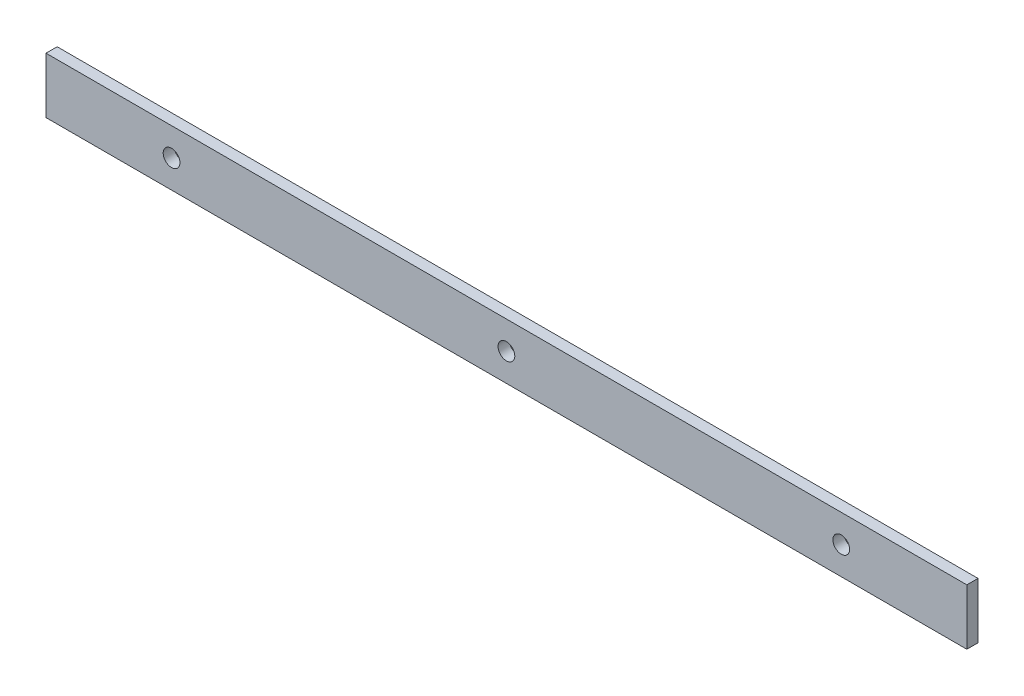
ISO-10303-21;
HEADER;
FILE_DESCRIPTION(('STEP AP214'),'2;1');
FILE_NAME('part.step','',(''),(''),'','','');
FILE_SCHEMA(('AUTOMOTIVE_DESIGN { 1 0 10303 214 1 1 1 1 }'));
ENDSEC;
DATA;
#1=APPLICATION_CONTEXT('core data for automotive mechanical design processes');
#2=APPLICATION_PROTOCOL_DEFINITION('international standard','automotive_design',2000,#1);
#3=PRODUCT_CONTEXT('',#1,'mechanical');
#4=PRODUCT('Part','Part','',(#3));
#5=PRODUCT_RELATED_PRODUCT_CATEGORY('part','',(#4));
#6=PRODUCT_DEFINITION_FORMATION('','',#4);
#7=PRODUCT_DEFINITION_CONTEXT('part definition',#1,'design');
#8=PRODUCT_DEFINITION('design','',#6,#7);
#9=PRODUCT_DEFINITION_SHAPE('','',#8);
#10=(LENGTH_UNIT() NAMED_UNIT(*) SI_UNIT(.MILLI.,.METRE.));
#11=(NAMED_UNIT(*) PLANE_ANGLE_UNIT() SI_UNIT($,.RADIAN.));
#12=(NAMED_UNIT(*) SI_UNIT($,.STERADIAN.) SOLID_ANGLE_UNIT());
#13=UNCERTAINTY_MEASURE_WITH_UNIT(LENGTH_MEASURE(1.E-05),#10,'distance_accuracy_value','');
#14=(GEOMETRIC_REPRESENTATION_CONTEXT(3) GLOBAL_UNCERTAINTY_ASSIGNED_CONTEXT((#13)) GLOBAL_UNIT_ASSIGNED_CONTEXT((#10,
#11,#12)) REPRESENTATION_CONTEXT('',''));
#15=CARTESIAN_POINT('',(0.,0.,0.));
#16=DIRECTION('',(0.,0.,1.));
#17=DIRECTION('',(1.,0.,0.));
#18=AXIS2_PLACEMENT_3D('',#15,#16,#17);
#19=CARTESIAN_POINT('',(165.,-10.,0.));
#20=DIRECTION('',(1.,0.,0.));
#21=DIRECTION('',(0.,1.,0.));
#22=AXIS2_PLACEMENT_3D('',#19,#20,#21);
#23=PLANE('',#22);
#24=DIRECTION('',(0.,0.,0.999999999999968));
#25=VECTOR('',#24,1.);
#26=CARTESIAN_POINT('',(165.,-10.,0.));
#27=LINE('',#26,#25);
#28=CARTESIAN_POINT('',(165.,-9.99999999999936,-3.99999999999989));
#29=VERTEX_POINT('',#28);
#30=CARTESIAN_POINT('',(165.,-10.,0.));
#31=VERTEX_POINT('',#30);
#32=EDGE_CURVE('E11',#29,#31,#27,.T.);
#33=ORIENTED_EDGE('',*,*,#32,.F.);
#34=DIRECTION('',(0.,0.999999999999967,0.));
#35=VECTOR('',#34,1.);
#36=CARTESIAN_POINT('',(165.,0.,-3.99999999999989));
#37=LINE('',#36,#35);
#38=CARTESIAN_POINT('',(165.,9.99999999999936,-3.99999999999989));
#39=VERTEX_POINT('',#38);
#40=EDGE_CURVE('E97',#29,#39,#37,.T.);
#41=ORIENTED_EDGE('',*,*,#40,.T.);
#42=DIRECTION('',(0.,0.,0.999999999999968));
#43=VECTOR('',#42,1.);
#44=CARTESIAN_POINT('',(165.,10.,0.));
#45=LINE('',#44,#43);
#46=CARTESIAN_POINT('',(165.,10.,0.));
#47=VERTEX_POINT('',#46);
#48=EDGE_CURVE('E53',#39,#47,#45,.T.);
#49=ORIENTED_EDGE('',*,*,#48,.T.);
#50=DIRECTION('',(0.,1.,0.));
#51=VECTOR('',#50,1.);
#52=CARTESIAN_POINT('',(165.,-10.,0.));
#53=LINE('',#52,#51);
#54=EDGE_CURVE('E119',#31,#47,#53,.T.);
#55=ORIENTED_EDGE('',*,*,#54,.F.);
#56=EDGE_LOOP('',(#33,#41,#49,#55));
#57=FACE_BOUND('',#56,.T.);
#58=ADVANCED_FACE('F43',(#57),#23,.T.);
#59=CARTESIAN_POINT('',(165.,10.,0.));
#60=DIRECTION('',(0.,1.,0.));
#61=DIRECTION('',(-0.999999999999999,0.,0.));
#62=AXIS2_PLACEMENT_3D('',#59,#60,#61);
#63=PLANE('',#62);
#64=ORIENTED_EDGE('',*,*,#48,.F.);
#65=DIRECTION('',(1.,0.,0.));
#66=VECTOR('',#65,1.);
#67=CARTESIAN_POINT('',(0.,9.99999999999939,-3.99999999999987));
#68=LINE('',#67,#66);
#69=CARTESIAN_POINT('',(-164.999999999999,9.99999999999941,-3.99999999999986));
#70=VERTEX_POINT('',#69);
#71=EDGE_CURVE('E111',#39,#70,#68,.F.);
#72=ORIENTED_EDGE('',*,*,#71,.T.);
#73=DIRECTION('',(0.,0.,0.999999999999968));
#74=VECTOR('',#73,1.);
#75=CARTESIAN_POINT('',(-165.,10.0000000000001,0.));
#76=LINE('',#75,#74);
#77=CARTESIAN_POINT('',(-165.,10.0000000000001,0.));
#78=VERTEX_POINT('',#77);
#79=EDGE_CURVE('E61',#70,#78,#76,.T.);
#80=ORIENTED_EDGE('',*,*,#79,.T.);
#81=DIRECTION('',(-0.999999999999999,0.,0.));
#82=VECTOR('',#81,1.);
#83=CARTESIAN_POINT('',(165.,10.,0.));
#84=LINE('',#83,#82);
#85=EDGE_CURVE('E91',#47,#78,#84,.T.);
#86=ORIENTED_EDGE('',*,*,#85,.F.);
#87=EDGE_LOOP('',(#64,#72,#80,#86));
#88=FACE_BOUND('',#87,.T.);
#89=ADVANCED_FACE('F125',(#88),#63,.T.);
#90=CARTESIAN_POINT('',(-164.999999999999,-10.,0.));
#91=DIRECTION('',(-1.,0.,0.));
#92=DIRECTION('',(0.,-1.,0.));
#93=AXIS2_PLACEMENT_3D('',#90,#91,#92);
#94=PLANE('',#93);
#95=ORIENTED_EDGE('',*,*,#79,.F.);
#96=DIRECTION('',(0.,0.999999999999967,0.));
#97=VECTOR('',#96,1.);
#98=CARTESIAN_POINT('',(-164.999999999999,0.,-3.99999999999986));
#99=LINE('',#98,#97);
#100=CARTESIAN_POINT('',(-164.999999999999,-9.99999999999936,-3.99999999999986));
#101=VERTEX_POINT('',#100);
#102=EDGE_CURVE('E96',#70,#101,#99,.F.);
#103=ORIENTED_EDGE('',*,*,#102,.T.);
#104=DIRECTION('',(0.,0.,0.999999999999968));
#105=VECTOR('',#104,1.);
#106=CARTESIAN_POINT('',(-164.999999999999,-10.,0.));
#107=LINE('',#106,#105);
#108=CARTESIAN_POINT('',(-164.999999999999,-10.,0.));
#109=VERTEX_POINT('',#108);
#110=EDGE_CURVE('E47',#101,#109,#107,.T.);
#111=ORIENTED_EDGE('',*,*,#110,.T.);
#112=DIRECTION('',(0.,-1.,0.));
#113=VECTOR('',#112,1.);
#114=CARTESIAN_POINT('',(-164.999999999999,-10.,0.));
#115=LINE('',#114,#113);
#116=EDGE_CURVE('E273',#78,#109,#115,.T.);
#117=ORIENTED_EDGE('',*,*,#116,.F.);
#118=EDGE_LOOP('',(#95,#103,#111,#117));
#119=FACE_BOUND('',#118,.T.);
#120=ADVANCED_FACE('F100',(#119),#94,.T.);
#121=CARTESIAN_POINT('',(-120.,0.,0.));
#122=DIRECTION('',(0.,0.,0.999999999999968));
#123=DIRECTION('',(0.,-1.,0.));
#124=AXIS2_PLACEMENT_3D('',#121,#122,#123);
#125=CYLINDRICAL_SURFACE('',#124,2.99999999999999);
#126=CARTESIAN_POINT('',(-120.,0.,0.));
#127=DIRECTION('',(0.,0.,0.999999999999968));
#128=DIRECTION('',(1.,0.,0.));
#129=AXIS2_PLACEMENT_3D('',#126,#127,#128);
#130=CIRCLE('',#129,2.99999999999999);
#131=CARTESIAN_POINT('',(-117.,0.,0.));
#132=VERTEX_POINT('',#131);
#133=EDGE_CURVE('E114',#132,#132,#130,.T.);
#134=ORIENTED_EDGE('',*,*,#133,.T.);
#135=EDGE_LOOP('',(#134));
#136=FACE_BOUND('',#135,.T.);
#137=CARTESIAN_POINT('',(-120.,0.,-3.99999999999961));
#138=DIRECTION('',(0.,0.,0.999999999999968));
#139=DIRECTION('',(0.,-1.,0.));
#140=AXIS2_PLACEMENT_3D('',#137,#138,#139);
#141=CIRCLE('',#140,2.99999999999999);
#142=CARTESIAN_POINT('',(-120.,-2.99999999999999,-3.99999999999961));
#143=VERTEX_POINT('',#142);
#144=EDGE_CURVE('E131',#143,#143,#141,.T.);
#145=ORIENTED_EDGE('',*,*,#144,.F.);
#146=EDGE_LOOP('',(#145));
#147=FACE_BOUND('',#146,.T.);
#148=ADVANCED_FACE('F144',(#136,#147),#125,.F.);
#149=CARTESIAN_POINT('',(0.,0.,0.));
#150=DIRECTION('',(0.,0.,0.999999999999968));
#151=DIRECTION('',(0.,-1.,0.));
#152=AXIS2_PLACEMENT_3D('',#149,#150,#151);
#153=CYLINDRICAL_SURFACE('',#152,2.99999999999999);
#154=CARTESIAN_POINT('',(0.,0.,0.));
#155=DIRECTION('',(0.,0.,0.999999999999968));
#156=DIRECTION('',(1.,0.,0.));
#157=AXIS2_PLACEMENT_3D('',#154,#155,#156);
#158=CIRCLE('',#157,2.99999999999999);
#159=CARTESIAN_POINT('',(2.99999999999999,0.,0.));
#160=VERTEX_POINT('',#159);
#161=EDGE_CURVE('E268',#160,#160,#158,.T.);
#162=ORIENTED_EDGE('',*,*,#161,.T.);
#163=EDGE_LOOP('',(#162));
#164=FACE_BOUND('',#163,.T.);
#165=CARTESIAN_POINT('',(0.,0.,-3.99999999999961));
#166=DIRECTION('',(0.,0.,0.999999999999968));
#167=DIRECTION('',(0.,-1.,0.));
#168=AXIS2_PLACEMENT_3D('',#165,#166,#167);
#169=CIRCLE('',#168,2.99999999999999);
#170=CARTESIAN_POINT('',(0.,-2.99999999999999,-3.99999999999961));
#171=VERTEX_POINT('',#170);
#172=EDGE_CURVE('E107',#171,#171,#169,.T.);
#173=ORIENTED_EDGE('',*,*,#172,.F.);
#174=EDGE_LOOP('',(#173));
#175=FACE_BOUND('',#174,.T.);
#176=ADVANCED_FACE('F141',(#164,#175),#153,.F.);
#177=CARTESIAN_POINT('',(120.,0.,0.));
#178=DIRECTION('',(0.,0.,0.999999999999968));
#179=DIRECTION('',(0.,-1.,0.));
#180=AXIS2_PLACEMENT_3D('',#177,#178,#179);
#181=CYLINDRICAL_SURFACE('',#180,2.99999999999999);
#182=CARTESIAN_POINT('',(120.,0.,0.));
#183=DIRECTION('',(0.,0.,0.999999999999968));
#184=DIRECTION('',(1.,0.,0.));
#185=AXIS2_PLACEMENT_3D('',#182,#183,#184);
#186=CIRCLE('',#185,2.99999999999999);
#187=CARTESIAN_POINT('',(123.,0.,0.));
#188=VERTEX_POINT('',#187);
#189=EDGE_CURVE('E271',#188,#188,#186,.T.);
#190=ORIENTED_EDGE('',*,*,#189,.T.);
#191=EDGE_LOOP('',(#190));
#192=FACE_BOUND('',#191,.T.);
#193=CARTESIAN_POINT('',(120.,0.,-3.99999999999961));
#194=DIRECTION('',(0.,0.,0.999999999999968));
#195=DIRECTION('',(0.,-1.,0.));
#196=AXIS2_PLACEMENT_3D('',#193,#194,#195);
#197=CIRCLE('',#196,2.99999999999999);
#198=CARTESIAN_POINT('',(120.,-2.99999999999993,-3.99999999999961));
#199=VERTEX_POINT('',#198);
#200=EDGE_CURVE('E102',#199,#199,#197,.T.);
#201=ORIENTED_EDGE('',*,*,#200,.F.);
#202=EDGE_LOOP('',(#201));
#203=FACE_BOUND('',#202,.T.);
#204=ADVANCED_FACE('F143',(#192,#203),#181,.F.);
#205=CARTESIAN_POINT('',(165.,-10.,0.));
#206=DIRECTION('',(0.,-1.,0.));
#207=DIRECTION('',(0.999999999999999,0.,0.));
#208=AXIS2_PLACEMENT_3D('',#205,#206,#207);
#209=PLANE('',#208);
#210=DIRECTION('',(1.,0.,0.));
#211=VECTOR('',#210,1.);
#212=CARTESIAN_POINT('',(0.,-9.99999999999939,-3.99999999999987));
#213=LINE('',#212,#211);
#214=EDGE_CURVE('E85',#101,#29,#213,.T.);
#215=ORIENTED_EDGE('',*,*,#214,.T.);
#216=ORIENTED_EDGE('',*,*,#32,.T.);
#217=DIRECTION('',(0.999999999999999,0.,0.));
#218=VECTOR('',#217,1.);
#219=CARTESIAN_POINT('',(165.,-10.,0.));
#220=LINE('',#219,#218);
#221=EDGE_CURVE('E87',#109,#31,#220,.T.);
#222=ORIENTED_EDGE('',*,*,#221,.F.);
#223=ORIENTED_EDGE('',*,*,#110,.F.);
#224=EDGE_LOOP('',(#215,#216,#222,#223));
#225=FACE_BOUND('',#224,.T.);
#226=ADVANCED_FACE('F45',(#225),#209,.T.);
#227=CARTESIAN_POINT('',(0.,0.,0.));
#228=DIRECTION('',(0.,0.,0.999999999999968));
#229=DIRECTION('',(1.,0.,0.));
#230=AXIS2_PLACEMENT_3D('',#227,#228,#229);
#231=PLANE('',#230);
#232=ORIENTED_EDGE('',*,*,#133,.F.);
#233=EDGE_LOOP('',(#232));
#234=FACE_BOUND('',#233,.T.);
#235=ORIENTED_EDGE('',*,*,#161,.F.);
#236=EDGE_LOOP('',(#235));
#237=FACE_BOUND('',#236,.T.);
#238=ORIENTED_EDGE('',*,*,#189,.F.);
#239=EDGE_LOOP('',(#238));
#240=FACE_BOUND('',#239,.T.);
#241=ORIENTED_EDGE('',*,*,#116,.T.);
#242=ORIENTED_EDGE('',*,*,#221,.T.);
#243=ORIENTED_EDGE('',*,*,#54,.T.);
#244=ORIENTED_EDGE('',*,*,#85,.T.);
#245=EDGE_LOOP('',(#241,#242,#243,#244));
#246=FACE_BOUND('',#245,.T.);
#247=ADVANCED_FACE('F122',(#234,#237,#240,#246),#231,.T.);
#248=CARTESIAN_POINT('',(0.,0.,-3.99999999999987));
#249=DIRECTION('',(0.,0.,0.999999999999968));
#250=DIRECTION('',(1.,0.,0.));
#251=AXIS2_PLACEMENT_3D('',#248,#249,#250);
#252=PLANE('',#251);
#253=ORIENTED_EDGE('',*,*,#144,.T.);
#254=EDGE_LOOP('',(#253));
#255=FACE_BOUND('',#254,.T.);
#256=ORIENTED_EDGE('',*,*,#172,.T.);
#257=EDGE_LOOP('',(#256));
#258=FACE_BOUND('',#257,.T.);
#259=ORIENTED_EDGE('',*,*,#200,.T.);
#260=EDGE_LOOP('',(#259));
#261=FACE_BOUND('',#260,.T.);
#262=ORIENTED_EDGE('',*,*,#102,.F.);
#263=ORIENTED_EDGE('',*,*,#71,.F.);
#264=ORIENTED_EDGE('',*,*,#40,.F.);
#265=ORIENTED_EDGE('',*,*,#214,.F.);
#266=EDGE_LOOP('',(#262,#263,#264,#265));
#267=FACE_BOUND('',#266,.T.);
#268=ADVANCED_FACE('F94',(#255,#258,#261,#267),#252,.F.);
#269=CLOSED_SHELL('',(#58,#89,#120,#148,#176,#204,#226,#247,#268));
#270=MANIFOLD_SOLID_BREP('B2',#269);
#271=ADVANCED_BREP_SHAPE_REPRESENTATION('',(#18,#270),#14);
#272=SHAPE_DEFINITION_REPRESENTATION(#9,#271);
ENDSEC;
END-ISO-10303-21;
